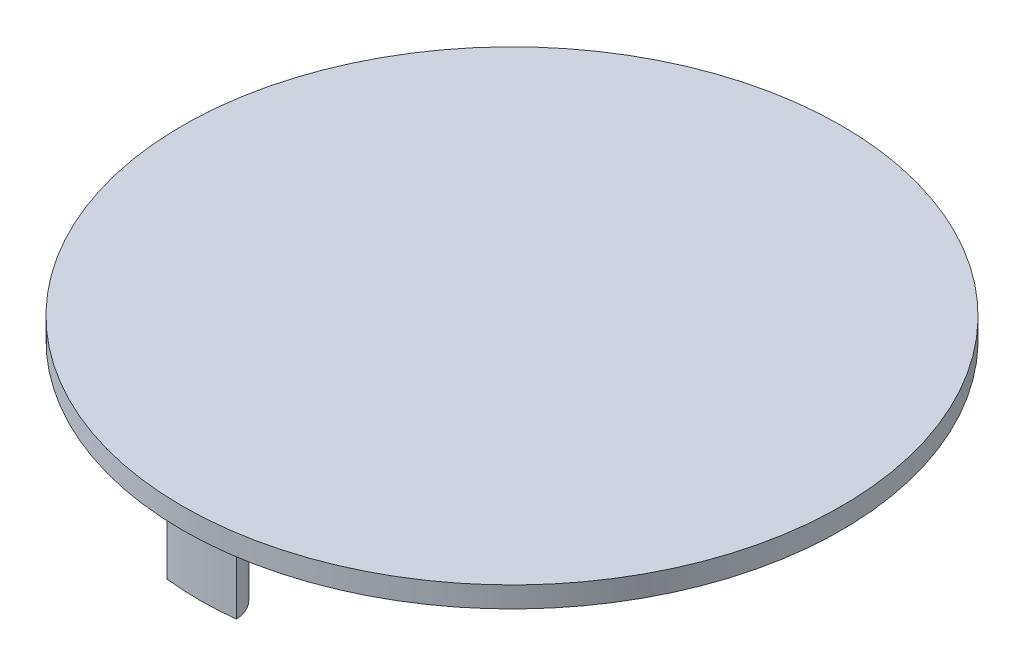
ISO-10303-21;
HEADER;
FILE_DESCRIPTION(('STEP AP214'),'2;1');
FILE_NAME('part.step','',(''),(''),'','','');
FILE_SCHEMA(('AUTOMOTIVE_DESIGN { 1 0 10303 214 1 1 1 1 }'));
ENDSEC;
DATA;
#1=APPLICATION_CONTEXT('core data for automotive mechanical design processes');
#2=APPLICATION_PROTOCOL_DEFINITION('international standard','automotive_design',2000,#1);
#3=PRODUCT_CONTEXT('',#1,'mechanical');
#4=PRODUCT('Part','Part','',(#3));
#5=PRODUCT_RELATED_PRODUCT_CATEGORY('part','',(#4));
#6=PRODUCT_DEFINITION_FORMATION('','',#4);
#7=PRODUCT_DEFINITION_CONTEXT('part definition',#1,'design');
#8=PRODUCT_DEFINITION('design','',#6,#7);
#9=PRODUCT_DEFINITION_SHAPE('','',#8);
#10=(LENGTH_UNIT() NAMED_UNIT(*) SI_UNIT(.MILLI.,.METRE.));
#11=(NAMED_UNIT(*) PLANE_ANGLE_UNIT() SI_UNIT($,.RADIAN.));
#12=(NAMED_UNIT(*) SI_UNIT($,.STERADIAN.) SOLID_ANGLE_UNIT());
#13=UNCERTAINTY_MEASURE_WITH_UNIT(LENGTH_MEASURE(1.E-05),#10,'distance_accuracy_value','');
#14=(GEOMETRIC_REPRESENTATION_CONTEXT(3) GLOBAL_UNCERTAINTY_ASSIGNED_CONTEXT((#13)) GLOBAL_UNIT_ASSIGNED_CONTEXT((#10,
#11,#12)) REPRESENTATION_CONTEXT('',''));
#15=CARTESIAN_POINT('',(0.,0.,0.));
#16=DIRECTION('',(0.,0.,1.));
#17=DIRECTION('',(1.,0.,0.));
#18=AXIS2_PLACEMENT_3D('',#15,#16,#17);
#19=CARTESIAN_POINT('',(0.,3.,0.));
#20=DIRECTION('',(0.,-1.,0.));
#21=DIRECTION('',(0.,0.,-1.));
#22=AXIS2_PLACEMENT_3D('',#19,#20,#21);
#23=CYLINDRICAL_SURFACE('',#22,47.5);
#24=CARTESIAN_POINT('',(0.,3.,0.));
#25=DIRECTION('',(0.,1.,0.));
#26=DIRECTION('',(0.,0.,1.));
#27=AXIS2_PLACEMENT_3D('',#24,#25,#26);
#28=CIRCLE('',#27,47.5);
#29=CARTESIAN_POINT('',(0.,3.,47.5));
#30=VERTEX_POINT('',#29);
#31=EDGE_CURVE('E11',#30,#30,#28,.T.);
#32=ORIENTED_EDGE('',*,*,#31,.F.);
#33=EDGE_LOOP('',(#32));
#34=FACE_BOUND('',#33,.T.);
#35=CARTESIAN_POINT('',(0.,0.,0.));
#36=DIRECTION('',(0.,1.,0.));
#37=DIRECTION('',(0.,0.,1.));
#38=AXIS2_PLACEMENT_3D('',#35,#36,#37);
#39=CIRCLE('',#38,47.5);
#40=CARTESIAN_POINT('',(0.,0.,47.5));
#41=VERTEX_POINT('',#40);
#42=EDGE_CURVE('E42',#41,#41,#39,.T.);
#43=ORIENTED_EDGE('',*,*,#42,.T.);
#44=EDGE_LOOP('',(#43));
#45=FACE_BOUND('',#44,.T.);
#46=ADVANCED_FACE('F39',(#34,#45),#23,.T.);
#47=CARTESIAN_POINT('',(0.,3.,0.));
#48=DIRECTION('',(0.,1.,0.));
#49=DIRECTION('',(0.,0.,1.));
#50=AXIS2_PLACEMENT_3D('',#47,#48,#49);
#51=PLANE('',#50);
#52=ORIENTED_EDGE('',*,*,#31,.T.);
#53=EDGE_LOOP('',(#52));
#54=FACE_BOUND('',#53,.T.);
#55=ADVANCED_FACE('F99',(#54),#51,.T.);
#56=CARTESIAN_POINT('',(0.,0.,0.));
#57=DIRECTION('',(0.,1.,0.));
#58=DIRECTION('',(0.,0.,1.));
#59=AXIS2_PLACEMENT_3D('',#56,#57,#58);
#60=PLANE('',#59);
#61=CARTESIAN_POINT('',(0.,0.,45.));
#62=DIRECTION('',(0.,-1.,0.));
#63=DIRECTION('',(0.,0.,-1.));
#64=AXIS2_PLACEMENT_3D('',#61,#62,#63);
#65=CIRCLE('',#64,5.);
#66=CARTESIAN_POINT('',(-4.99227798766983,0.,44.7222222222222));
#67=VERTEX_POINT('',#66);
#68=CARTESIAN_POINT('',(4.99227798766985,0.,44.7222222222222));
#69=VERTEX_POINT('',#68);
#70=EDGE_CURVE('E66',#67,#69,#65,.T.);
#71=ORIENTED_EDGE('',*,*,#70,.F.);
#72=CARTESIAN_POINT('',(0.,0.,0.));
#73=DIRECTION('',(0.,-1.,0.));
#74=DIRECTION('',(0.,0.,-1.));
#75=AXIS2_PLACEMENT_3D('',#72,#73,#74);
#76=CIRCLE('',#75,45.);
#77=EDGE_CURVE('E53',#69,#67,#76,.T.);
#78=ORIENTED_EDGE('',*,*,#77,.F.);
#79=EDGE_LOOP('',(#71,#78));
#80=FACE_BOUND('',#79,.T.);
#81=ORIENTED_EDGE('',*,*,#42,.F.);
#82=EDGE_LOOP('',(#81));
#83=FACE_BOUND('',#82,.T.);
#84=ADVANCED_FACE('F67',(#80,#83),#60,.F.);
#85=CARTESIAN_POINT('',(0.,-10.,45.));
#86=DIRECTION('',(0.,1.,0.));
#87=DIRECTION('',(0.,0.,1.));
#88=AXIS2_PLACEMENT_3D('',#85,#86,#87);
#89=CYLINDRICAL_SURFACE('',#88,5.);
#90=ORIENTED_EDGE('',*,*,#70,.T.);
#91=DIRECTION('',(0.,1.,0.));
#92=VECTOR('',#91,1.);
#93=CARTESIAN_POINT('',(4.99227798766985,-10.,44.7222222222222));
#94=LINE('',#93,#92);
#95=CARTESIAN_POINT('',(4.99227798766985,-10.,44.7222222222222));
#96=VERTEX_POINT('',#95);
#97=EDGE_CURVE('E78',#96,#69,#94,.T.);
#98=ORIENTED_EDGE('',*,*,#97,.F.);
#99=CARTESIAN_POINT('',(0.,-10.,45.));
#100=DIRECTION('',(0.,-1.,0.));
#101=DIRECTION('',(0.,0.,-1.));
#102=AXIS2_PLACEMENT_3D('',#99,#100,#101);
#103=CIRCLE('',#102,5.);
#104=CARTESIAN_POINT('',(-4.99227798766983,-10.,44.7222222222222));
#105=VERTEX_POINT('',#104);
#106=EDGE_CURVE('E80',#105,#96,#103,.T.);
#107=ORIENTED_EDGE('',*,*,#106,.F.);
#108=DIRECTION('',(0.,1.,0.));
#109=VECTOR('',#108,1.);
#110=CARTESIAN_POINT('',(-4.99227798766983,-10.,44.7222222222222));
#111=LINE('',#110,#109);
#112=EDGE_CURVE('E76',#105,#67,#111,.T.);
#113=ORIENTED_EDGE('',*,*,#112,.T.);
#114=EDGE_LOOP('',(#90,#98,#107,#113));
#115=FACE_BOUND('',#114,.T.);
#116=ADVANCED_FACE('F82',(#115),#89,.T.);
#117=CARTESIAN_POINT('',(0.,-10.,0.));
#118=DIRECTION('',(0.,1.,0.));
#119=DIRECTION('',(0.,0.,1.));
#120=AXIS2_PLACEMENT_3D('',#117,#118,#119);
#121=CYLINDRICAL_SURFACE('',#120,45.);
#122=ORIENTED_EDGE('',*,*,#77,.T.);
#123=ORIENTED_EDGE('',*,*,#112,.F.);
#124=CARTESIAN_POINT('',(0.,-10.,0.));
#125=DIRECTION('',(0.,-1.,0.));
#126=DIRECTION('',(0.,0.,-1.));
#127=AXIS2_PLACEMENT_3D('',#124,#125,#126);
#128=CIRCLE('',#127,45.);
#129=EDGE_CURVE('E61',#96,#105,#128,.T.);
#130=ORIENTED_EDGE('',*,*,#129,.F.);
#131=ORIENTED_EDGE('',*,*,#97,.T.);
#132=EDGE_LOOP('',(#122,#123,#130,#131));
#133=FACE_BOUND('',#132,.T.);
#134=ADVANCED_FACE('F75',(#133),#121,.T.);
#135=CARTESIAN_POINT('',(0.,-10.,22.5));
#136=DIRECTION('',(0.,-1.,0.));
#137=DIRECTION('',(0.,0.,-1.));
#138=AXIS2_PLACEMENT_3D('',#135,#136,#137);
#139=PLANE('',#138);
#140=ORIENTED_EDGE('',*,*,#106,.T.);
#141=ORIENTED_EDGE('',*,*,#129,.T.);
#142=EDGE_LOOP('',(#140,#141));
#143=FACE_BOUND('',#142,.T.);
#144=ADVANCED_FACE('F91',(#143),#139,.T.);
#145=CLOSED_SHELL('',(#46,#55,#84,#116,#134,#144));
#146=MANIFOLD_SOLID_BREP('B2',#145);
#147=ADVANCED_BREP_SHAPE_REPRESENTATION('',(#18,#146),#14);
#148=SHAPE_DEFINITION_REPRESENTATION(#9,#147);
ENDSEC;
END-ISO-10303-21;
